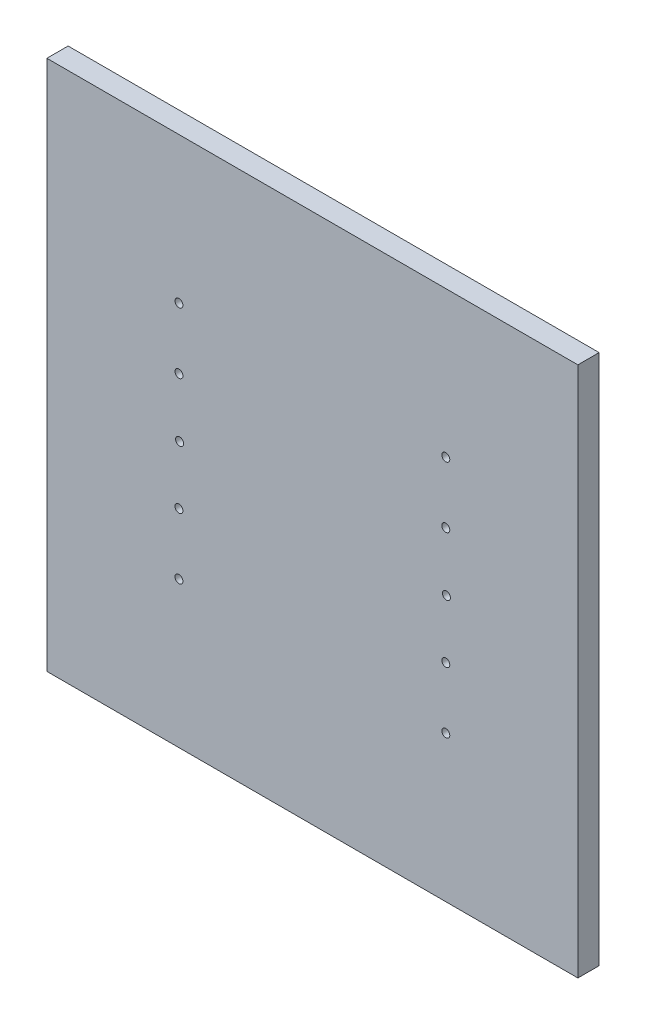
ISO-10303-21;
HEADER;
FILE_DESCRIPTION(('STEP AP214'),'2;1');
FILE_NAME('part.step','',(''),(''),'','','');
FILE_SCHEMA(('AUTOMOTIVE_DESIGN { 1 0 10303 214 1 1 1 1 }'));
ENDSEC;
DATA;
#1=APPLICATION_CONTEXT('core data for automotive mechanical design processes');
#2=APPLICATION_PROTOCOL_DEFINITION('international standard','automotive_design',2000,#1);
#3=PRODUCT_CONTEXT('',#1,'mechanical');
#4=PRODUCT('Part','Part','',(#3));
#5=PRODUCT_RELATED_PRODUCT_CATEGORY('part','',(#4));
#6=PRODUCT_DEFINITION_FORMATION('','',#4);
#7=PRODUCT_DEFINITION_CONTEXT('part definition',#1,'design');
#8=PRODUCT_DEFINITION('design','',#6,#7);
#9=PRODUCT_DEFINITION_SHAPE('','',#8);
#10=(LENGTH_UNIT() NAMED_UNIT(*) SI_UNIT(.MILLI.,.METRE.));
#11=(NAMED_UNIT(*) PLANE_ANGLE_UNIT() SI_UNIT($,.RADIAN.));
#12=(NAMED_UNIT(*) SI_UNIT($,.STERADIAN.) SOLID_ANGLE_UNIT());
#13=UNCERTAINTY_MEASURE_WITH_UNIT(LENGTH_MEASURE(1.E-05),#10,'distance_accuracy_value','');
#14=(GEOMETRIC_REPRESENTATION_CONTEXT(3) GLOBAL_UNCERTAINTY_ASSIGNED_CONTEXT((#13)) GLOBAL_UNIT_ASSIGNED_CONTEXT((#10,
#11,#12)) REPRESENTATION_CONTEXT('',''));
#15=CARTESIAN_POINT('',(0.,0.,0.));
#16=DIRECTION('',(0.,0.,1.));
#17=DIRECTION('',(1.,0.,0.));
#18=AXIS2_PLACEMENT_3D('',#15,#16,#17);
#19=CARTESIAN_POINT('',(0.,0.,8.));
#20=DIRECTION('',(1.,0.,0.));
#21=DIRECTION('',(0.,0.,-1.));
#22=AXIS2_PLACEMENT_3D('',#19,#20,#21);
#23=PLANE('',#22);
#24=DIRECTION('',(0.,-1.,0.));
#25=VECTOR('',#24,1.);
#26=CARTESIAN_POINT('',(0.,0.,0.));
#27=LINE('',#26,#25);
#28=CARTESIAN_POINT('',(0.,200.,0.));
#29=VERTEX_POINT('',#28);
#30=CARTESIAN_POINT('',(0.,0.,0.));
#31=VERTEX_POINT('',#30);
#32=EDGE_CURVE('E101',#29,#31,#27,.T.);
#33=ORIENTED_EDGE('',*,*,#32,.T.);
#34=DIRECTION('',(0.,0.,-1.));
#35=VECTOR('',#34,1.);
#36=CARTESIAN_POINT('',(0.,0.,8.));
#37=LINE('',#36,#35);
#38=CARTESIAN_POINT('',(0.,0.,8.));
#39=VERTEX_POINT('',#38);
#40=EDGE_CURVE('E11',#39,#31,#37,.T.);
#41=ORIENTED_EDGE('',*,*,#40,.F.);
#42=DIRECTION('',(0.,-1.,0.));
#43=VECTOR('',#42,1.);
#44=CARTESIAN_POINT('',(0.,0.,8.));
#45=LINE('',#44,#43);
#46=CARTESIAN_POINT('',(0.,200.,8.));
#47=VERTEX_POINT('',#46);
#48=EDGE_CURVE('E88',#47,#39,#45,.T.);
#49=ORIENTED_EDGE('',*,*,#48,.F.);
#50=DIRECTION('',(0.,0.,-1.));
#51=VECTOR('',#50,1.);
#52=CARTESIAN_POINT('',(0.,200.,8.));
#53=LINE('',#52,#51);
#54=EDGE_CURVE('E97',#47,#29,#53,.T.);
#55=ORIENTED_EDGE('',*,*,#54,.T.);
#56=EDGE_LOOP('',(#33,#41,#49,#55));
#57=FACE_BOUND('',#56,.T.);
#58=ADVANCED_FACE('F35',(#57),#23,.F.);
#59=CARTESIAN_POINT('',(0.,0.,8.));
#60=DIRECTION('',(0.,1.,0.));
#61=DIRECTION('',(0.,0.,1.));
#62=AXIS2_PLACEMENT_3D('',#59,#60,#61);
#63=PLANE('',#62);
#64=DIRECTION('',(1.,0.,0.));
#65=VECTOR('',#64,1.);
#66=CARTESIAN_POINT('',(0.,0.,0.));
#67=LINE('',#66,#65);
#68=CARTESIAN_POINT('',(200.,0.,0.));
#69=VERTEX_POINT('',#68);
#70=EDGE_CURVE('E92',#31,#69,#67,.T.);
#71=ORIENTED_EDGE('',*,*,#70,.T.);
#72=DIRECTION('',(0.,0.,-1.));
#73=VECTOR('',#72,1.);
#74=CARTESIAN_POINT('',(200.,0.,8.));
#75=LINE('',#74,#73);
#76=CARTESIAN_POINT('',(200.,0.,8.));
#77=VERTEX_POINT('',#76);
#78=EDGE_CURVE('E44',#77,#69,#75,.T.);
#79=ORIENTED_EDGE('',*,*,#78,.F.);
#80=DIRECTION('',(1.,0.,0.));
#81=VECTOR('',#80,1.);
#82=CARTESIAN_POINT('',(0.,0.,8.));
#83=LINE('',#82,#81);
#84=EDGE_CURVE('E83',#39,#77,#83,.T.);
#85=ORIENTED_EDGE('',*,*,#84,.F.);
#86=ORIENTED_EDGE('',*,*,#40,.T.);
#87=EDGE_LOOP('',(#71,#79,#85,#86));
#88=FACE_BOUND('',#87,.T.);
#89=ADVANCED_FACE('F91',(#88),#63,.F.);
#90=CARTESIAN_POINT('',(200.,0.,8.));
#91=DIRECTION('',(-1.,0.,0.));
#92=DIRECTION('',(0.,0.,1.));
#93=AXIS2_PLACEMENT_3D('',#90,#91,#92);
#94=PLANE('',#93);
#95=DIRECTION('',(0.,1.,0.));
#96=VECTOR('',#95,1.);
#97=CARTESIAN_POINT('',(200.,0.,0.));
#98=LINE('',#97,#96);
#99=CARTESIAN_POINT('',(200.,200.,0.));
#100=VERTEX_POINT('',#99);
#101=EDGE_CURVE('E70',#69,#100,#98,.T.);
#102=ORIENTED_EDGE('',*,*,#101,.T.);
#103=DIRECTION('',(0.,0.,-1.));
#104=VECTOR('',#103,1.);
#105=CARTESIAN_POINT('',(200.,200.,8.));
#106=LINE('',#105,#104);
#107=CARTESIAN_POINT('',(200.,200.,8.));
#108=VERTEX_POINT('',#107);
#109=EDGE_CURVE('E93',#108,#100,#106,.T.);
#110=ORIENTED_EDGE('',*,*,#109,.F.);
#111=DIRECTION('',(0.,1.,0.));
#112=VECTOR('',#111,1.);
#113=CARTESIAN_POINT('',(200.,0.,8.));
#114=LINE('',#113,#112);
#115=EDGE_CURVE('E86',#77,#108,#114,.T.);
#116=ORIENTED_EDGE('',*,*,#115,.F.);
#117=ORIENTED_EDGE('',*,*,#78,.T.);
#118=EDGE_LOOP('',(#102,#110,#116,#117));
#119=FACE_BOUND('',#118,.T.);
#120=ADVANCED_FACE('F95',(#119),#94,.F.);
#121=CARTESIAN_POINT('',(0.,200.,8.));
#122=DIRECTION('',(0.,-1.,0.));
#123=DIRECTION('',(0.,0.,-1.));
#124=AXIS2_PLACEMENT_3D('',#121,#122,#123);
#125=PLANE('',#124);
#126=DIRECTION('',(-1.,0.,0.));
#127=VECTOR('',#126,1.);
#128=CARTESIAN_POINT('',(0.,200.,0.));
#129=LINE('',#128,#127);
#130=EDGE_CURVE('E76',#100,#29,#129,.T.);
#131=ORIENTED_EDGE('',*,*,#130,.T.);
#132=ORIENTED_EDGE('',*,*,#54,.F.);
#133=DIRECTION('',(-1.,0.,0.));
#134=VECTOR('',#133,1.);
#135=CARTESIAN_POINT('',(0.,200.,8.));
#136=LINE('',#135,#134);
#137=EDGE_CURVE('E53',#108,#47,#136,.T.);
#138=ORIENTED_EDGE('',*,*,#137,.F.);
#139=ORIENTED_EDGE('',*,*,#109,.T.);
#140=EDGE_LOOP('',(#131,#132,#138,#139));
#141=FACE_BOUND('',#140,.T.);
#142=ADVANCED_FACE('F205',(#141),#125,.F.);
#143=CARTESIAN_POINT('',(0.,0.,8.));
#144=DIRECTION('',(0.,0.,-1.));
#145=DIRECTION('',(-1.,0.,0.));
#146=AXIS2_PLACEMENT_3D('',#143,#144,#145);
#147=PLANE('',#146);
#148=CARTESIAN_POINT('',(150.5,100.,8.));
#149=DIRECTION('',(0.,0.,-1.));
#150=DIRECTION('',(-1.,0.,0.));
#151=AXIS2_PLACEMENT_3D('',#148,#149,#150);
#152=CIRCLE('',#151,1.5);
#153=CARTESIAN_POINT('',(149.,100.,8.));
#154=VERTEX_POINT('',#153);
#155=EDGE_CURVE('E38',#154,#154,#152,.T.);
#156=ORIENTED_EDGE('',*,*,#155,.T.);
#157=EDGE_LOOP('',(#156));
#158=FACE_BOUND('',#157,.T.);
#159=CARTESIAN_POINT('',(150.25,145.,8.));
#160=DIRECTION('',(0.,0.,-1.));
#161=DIRECTION('',(-1.,0.,0.));
#162=AXIS2_PLACEMENT_3D('',#159,#160,#161);
#163=CIRCLE('',#162,1.5);
#164=CARTESIAN_POINT('',(148.75,145.,8.));
#165=VERTEX_POINT('',#164);
#166=EDGE_CURVE('E554',#165,#165,#163,.T.);
#167=ORIENTED_EDGE('',*,*,#166,.T.);
#168=EDGE_LOOP('',(#167));
#169=FACE_BOUND('',#168,.T.);
#170=CARTESIAN_POINT('',(150.25,121.99689141647,8.));
#171=DIRECTION('',(0.,0.,-1.));
#172=DIRECTION('',(-1.,0.,0.));
#173=AXIS2_PLACEMENT_3D('',#170,#171,#172);
#174=CIRCLE('',#173,1.5);
#175=CARTESIAN_POINT('',(148.75,121.99689141647,8.));
#176=VERTEX_POINT('',#175);
#177=EDGE_CURVE('E566',#176,#176,#174,.T.);
#178=ORIENTED_EDGE('',*,*,#177,.T.);
#179=EDGE_LOOP('',(#178));
#180=FACE_BOUND('',#179,.T.);
#181=CARTESIAN_POINT('',(150.25,78.0125142132843,8.));
#182=DIRECTION('',(0.,0.,-1.));
#183=DIRECTION('',(-1.,0.,0.));
#184=AXIS2_PLACEMENT_3D('',#181,#182,#183);
#185=CIRCLE('',#184,1.5);
#186=CARTESIAN_POINT('',(148.75,78.0125142132843,8.));
#187=VERTEX_POINT('',#186);
#188=EDGE_CURVE('E578',#187,#187,#185,.T.);
#189=ORIENTED_EDGE('',*,*,#188,.T.);
#190=EDGE_LOOP('',(#189));
#191=FACE_BOUND('',#190,.T.);
#192=CARTESIAN_POINT('',(150.25,55.0095344714492,8.));
#193=DIRECTION('',(0.,0.,-1.));
#194=DIRECTION('',(-1.,0.,0.));
#195=AXIS2_PLACEMENT_3D('',#192,#193,#194);
#196=CIRCLE('',#195,1.5);
#197=CARTESIAN_POINT('',(148.75,55.0095344714492,8.));
#198=VERTEX_POINT('',#197);
#199=EDGE_CURVE('E119',#198,#198,#196,.T.);
#200=ORIENTED_EDGE('',*,*,#199,.T.);
#201=EDGE_LOOP('',(#200));
#202=FACE_BOUND('',#201,.T.);
#203=CARTESIAN_POINT('',(50.,100.,8.));
#204=DIRECTION('',(0.,0.,-1.));
#205=DIRECTION('',(-1.,0.,0.));
#206=AXIS2_PLACEMENT_3D('',#203,#204,#205);
#207=CIRCLE('',#206,1.5);
#208=CARTESIAN_POINT('',(48.5,100.,8.));
#209=VERTEX_POINT('',#208);
#210=EDGE_CURVE('E109',#209,#209,#207,.T.);
#211=ORIENTED_EDGE('',*,*,#210,.T.);
#212=EDGE_LOOP('',(#211));
#213=FACE_BOUND('',#212,.T.);
#214=CARTESIAN_POINT('',(49.75,145.,8.));
#215=DIRECTION('',(0.,0.,-1.));
#216=DIRECTION('',(-1.,0.,0.));
#217=AXIS2_PLACEMENT_3D('',#214,#215,#216);
#218=CIRCLE('',#217,1.5);
#219=CARTESIAN_POINT('',(48.25,145.,8.));
#220=VERTEX_POINT('',#219);
#221=EDGE_CURVE('E139',#220,#220,#218,.T.);
#222=ORIENTED_EDGE('',*,*,#221,.T.);
#223=EDGE_LOOP('',(#222));
#224=FACE_BOUND('',#223,.T.);
#225=CARTESIAN_POINT('',(49.75,121.99689141647,8.));
#226=DIRECTION('',(0.,0.,-1.));
#227=DIRECTION('',(-1.,0.,0.));
#228=AXIS2_PLACEMENT_3D('',#225,#226,#227);
#229=CIRCLE('',#228,1.5);
#230=CARTESIAN_POINT('',(48.25,121.99689141647,8.));
#231=VERTEX_POINT('',#230);
#232=EDGE_CURVE('E151',#231,#231,#229,.T.);
#233=ORIENTED_EDGE('',*,*,#232,.T.);
#234=EDGE_LOOP('',(#233));
#235=FACE_BOUND('',#234,.T.);
#236=CARTESIAN_POINT('',(49.75,78.0125142132843,8.));
#237=DIRECTION('',(0.,0.,-1.));
#238=DIRECTION('',(-1.,0.,0.));
#239=AXIS2_PLACEMENT_3D('',#236,#237,#238);
#240=CIRCLE('',#239,1.5);
#241=CARTESIAN_POINT('',(48.25,78.0125142132843,8.));
#242=VERTEX_POINT('',#241);
#243=EDGE_CURVE('E163',#242,#242,#240,.T.);
#244=ORIENTED_EDGE('',*,*,#243,.T.);
#245=EDGE_LOOP('',(#244));
#246=FACE_BOUND('',#245,.T.);
#247=CARTESIAN_POINT('',(49.75,55.0095344714492,8.));
#248=DIRECTION('',(0.,0.,-1.));
#249=DIRECTION('',(-1.,0.,0.));
#250=AXIS2_PLACEMENT_3D('',#247,#248,#249);
#251=CIRCLE('',#250,1.5);
#252=CARTESIAN_POINT('',(48.25,55.0095344714492,8.));
#253=VERTEX_POINT('',#252);
#254=EDGE_CURVE('E104',#253,#253,#251,.T.);
#255=ORIENTED_EDGE('',*,*,#254,.T.);
#256=EDGE_LOOP('',(#255));
#257=FACE_BOUND('',#256,.T.);
#258=ORIENTED_EDGE('',*,*,#48,.T.);
#259=ORIENTED_EDGE('',*,*,#84,.T.);
#260=ORIENTED_EDGE('',*,*,#115,.T.);
#261=ORIENTED_EDGE('',*,*,#137,.T.);
#262=EDGE_LOOP('',(#258,#259,#260,#261));
#263=FACE_BOUND('',#262,.T.);
#264=ADVANCED_FACE('F84',(#158,#169,#180,#191,#202,#213,#224,#235,#246,#257,#263),#147,.F.);
#265=CARTESIAN_POINT('',(0.,0.,0.));
#266=DIRECTION('',(0.,0.,-1.));
#267=DIRECTION('',(-1.,0.,0.));
#268=AXIS2_PLACEMENT_3D('',#265,#266,#267);
#269=PLANE('',#268);
#270=CARTESIAN_POINT('',(150.5,100.,0.));
#271=DIRECTION('',(0.,0.,-1.));
#272=DIRECTION('',(-1.,0.,0.));
#273=AXIS2_PLACEMENT_3D('',#270,#271,#272);
#274=CIRCLE('',#273,2.5);
#275=CARTESIAN_POINT('',(148.,100.,0.));
#276=VERTEX_POINT('',#275);
#277=EDGE_CURVE('E537',#276,#276,#274,.T.);
#278=ORIENTED_EDGE('',*,*,#277,.F.);
#279=EDGE_LOOP('',(#278));
#280=FACE_BOUND('',#279,.T.);
#281=CARTESIAN_POINT('',(150.25,145.,0.));
#282=DIRECTION('',(0.,0.,-1.));
#283=DIRECTION('',(-1.,0.,0.));
#284=AXIS2_PLACEMENT_3D('',#281,#282,#283);
#285=CIRCLE('',#284,2.5);
#286=CARTESIAN_POINT('',(147.75,145.,0.));
#287=VERTEX_POINT('',#286);
#288=EDGE_CURVE('E544',#287,#287,#285,.T.);
#289=ORIENTED_EDGE('',*,*,#288,.F.);
#290=EDGE_LOOP('',(#289));
#291=FACE_BOUND('',#290,.T.);
#292=CARTESIAN_POINT('',(150.25,121.99689141647,0.));
#293=DIRECTION('',(0.,0.,-1.));
#294=DIRECTION('',(-1.,0.,0.));
#295=AXIS2_PLACEMENT_3D('',#292,#293,#294);
#296=CIRCLE('',#295,2.5);
#297=CARTESIAN_POINT('',(147.75,121.99689141647,0.));
#298=VERTEX_POINT('',#297);
#299=EDGE_CURVE('E557',#298,#298,#296,.T.);
#300=ORIENTED_EDGE('',*,*,#299,.F.);
#301=EDGE_LOOP('',(#300));
#302=FACE_BOUND('',#301,.T.);
#303=CARTESIAN_POINT('',(150.25,78.0125142132843,0.));
#304=DIRECTION('',(0.,0.,-1.));
#305=DIRECTION('',(-1.,0.,0.));
#306=AXIS2_PLACEMENT_3D('',#303,#304,#305);
#307=CIRCLE('',#306,2.5);
#308=CARTESIAN_POINT('',(147.75,78.0125142132843,0.));
#309=VERTEX_POINT('',#308);
#310=EDGE_CURVE('E569',#309,#309,#307,.T.);
#311=ORIENTED_EDGE('',*,*,#310,.F.);
#312=EDGE_LOOP('',(#311));
#313=FACE_BOUND('',#312,.T.);
#314=CARTESIAN_POINT('',(150.25,55.0095344714492,0.));
#315=DIRECTION('',(0.,0.,-1.));
#316=DIRECTION('',(-1.,0.,0.));
#317=AXIS2_PLACEMENT_3D('',#314,#315,#316);
#318=CIRCLE('',#317,2.5);
#319=CARTESIAN_POINT('',(147.75,55.0095344714492,0.));
#320=VERTEX_POINT('',#319);
#321=EDGE_CURVE('E581',#320,#320,#318,.T.);
#322=ORIENTED_EDGE('',*,*,#321,.F.);
#323=EDGE_LOOP('',(#322));
#324=FACE_BOUND('',#323,.T.);
#325=CARTESIAN_POINT('',(50.,100.,0.));
#326=DIRECTION('',(0.,0.,-1.));
#327=DIRECTION('',(-1.,0.,0.));
#328=AXIS2_PLACEMENT_3D('',#325,#326,#327);
#329=CIRCLE('',#328,2.5);
#330=CARTESIAN_POINT('',(47.5,100.,0.));
#331=VERTEX_POINT('',#330);
#332=EDGE_CURVE('E111',#331,#331,#329,.T.);
#333=ORIENTED_EDGE('',*,*,#332,.F.);
#334=EDGE_LOOP('',(#333));
#335=FACE_BOUND('',#334,.T.);
#336=CARTESIAN_POINT('',(49.75,145.,0.));
#337=DIRECTION('',(0.,0.,-1.));
#338=DIRECTION('',(-1.,0.,0.));
#339=AXIS2_PLACEMENT_3D('',#336,#337,#338);
#340=CIRCLE('',#339,2.5);
#341=CARTESIAN_POINT('',(47.25,145.,0.));
#342=VERTEX_POINT('',#341);
#343=EDGE_CURVE('E129',#342,#342,#340,.T.);
#344=ORIENTED_EDGE('',*,*,#343,.F.);
#345=EDGE_LOOP('',(#344));
#346=FACE_BOUND('',#345,.T.);
#347=CARTESIAN_POINT('',(49.75,121.99689141647,0.));
#348=DIRECTION('',(0.,0.,-1.));
#349=DIRECTION('',(-1.,0.,0.));
#350=AXIS2_PLACEMENT_3D('',#347,#348,#349);
#351=CIRCLE('',#350,2.5);
#352=CARTESIAN_POINT('',(47.25,121.99689141647,0.));
#353=VERTEX_POINT('',#352);
#354=EDGE_CURVE('E142',#353,#353,#351,.T.);
#355=ORIENTED_EDGE('',*,*,#354,.F.);
#356=EDGE_LOOP('',(#355));
#357=FACE_BOUND('',#356,.T.);
#358=CARTESIAN_POINT('',(49.75,78.0125142132843,0.));
#359=DIRECTION('',(0.,0.,-1.));
#360=DIRECTION('',(-1.,0.,0.));
#361=AXIS2_PLACEMENT_3D('',#358,#359,#360);
#362=CIRCLE('',#361,2.5);
#363=CARTESIAN_POINT('',(47.25,78.0125142132843,0.));
#364=VERTEX_POINT('',#363);
#365=EDGE_CURVE('E154',#364,#364,#362,.T.);
#366=ORIENTED_EDGE('',*,*,#365,.F.);
#367=EDGE_LOOP('',(#366));
#368=FACE_BOUND('',#367,.T.);
#369=CARTESIAN_POINT('',(49.75,55.0095344714492,0.));
#370=DIRECTION('',(0.,0.,-1.));
#371=DIRECTION('',(-1.,0.,0.));
#372=AXIS2_PLACEMENT_3D('',#369,#370,#371);
#373=CIRCLE('',#372,2.5);
#374=CARTESIAN_POINT('',(47.25,55.0095344714492,0.));
#375=VERTEX_POINT('',#374);
#376=EDGE_CURVE('E166',#375,#375,#373,.T.);
#377=ORIENTED_EDGE('',*,*,#376,.F.);
#378=EDGE_LOOP('',(#377));
#379=FACE_BOUND('',#378,.T.);
#380=ORIENTED_EDGE('',*,*,#32,.F.);
#381=ORIENTED_EDGE('',*,*,#130,.F.);
#382=ORIENTED_EDGE('',*,*,#101,.F.);
#383=ORIENTED_EDGE('',*,*,#70,.F.);
#384=EDGE_LOOP('',(#380,#381,#382,#383));
#385=FACE_BOUND('',#384,.T.);
#386=ADVANCED_FACE('F183',(#280,#291,#302,#313,#324,#335,#346,#357,#368,#379,#385),#269,.T.);
#387=CARTESIAN_POINT('',(49.75,55.0095344714492,0.));
#388=DIRECTION('',(0.,0.,-1.));
#389=DIRECTION('',(-1.,0.,0.));
#390=AXIS2_PLACEMENT_3D('',#387,#388,#389);
#391=CYLINDRICAL_SURFACE('',#390,1.5);
#392=ORIENTED_EDGE('',*,*,#254,.F.);
#393=EDGE_LOOP('',(#392));
#394=FACE_BOUND('',#393,.T.);
#395=CARTESIAN_POINT('',(49.75,55.0095344714492,4.));
#396=DIRECTION('',(0.,0.,-1.));
#397=DIRECTION('',(-1.,0.,0.));
#398=AXIS2_PLACEMENT_3D('',#395,#396,#397);
#399=CIRCLE('',#398,1.5);
#400=CARTESIAN_POINT('',(48.25,55.0095344714492,4.));
#401=VERTEX_POINT('',#400);
#402=EDGE_CURVE('E172',#401,#401,#399,.T.);
#403=ORIENTED_EDGE('',*,*,#402,.T.);
#404=EDGE_LOOP('',(#403));
#405=FACE_BOUND('',#404,.T.);
#406=ADVANCED_FACE('F179',(#394,#405),#391,.F.);
#407=CARTESIAN_POINT('',(51.25,55.0095344714492,4.));
#408=DIRECTION('',(0.,0.,1.));
#409=DIRECTION('',(1.,0.,0.));
#410=AXIS2_PLACEMENT_3D('',#407,#408,#409);
#411=PLANE('',#410);
#412=ORIENTED_EDGE('',*,*,#402,.F.);
#413=EDGE_LOOP('',(#412));
#414=FACE_BOUND('',#413,.T.);
#415=CARTESIAN_POINT('',(49.75,55.0095344714492,4.));
#416=DIRECTION('',(0.,0.,-1.));
#417=DIRECTION('',(-1.,0.,0.));
#418=AXIS2_PLACEMENT_3D('',#415,#416,#417);
#419=CIRCLE('',#418,2.5);
#420=CARTESIAN_POINT('',(47.25,55.0095344714492,4.));
#421=VERTEX_POINT('',#420);
#422=EDGE_CURVE('E169',#421,#421,#419,.T.);
#423=ORIENTED_EDGE('',*,*,#422,.T.);
#424=EDGE_LOOP('',(#423));
#425=FACE_BOUND('',#424,.T.);
#426=ADVANCED_FACE('F182',(#414,#425),#411,.F.);
#427=CARTESIAN_POINT('',(49.75,55.0095344714492,0.));
#428=DIRECTION('',(0.,0.,-1.));
#429=DIRECTION('',(-1.,0.,0.));
#430=AXIS2_PLACEMENT_3D('',#427,#428,#429);
#431=CYLINDRICAL_SURFACE('',#430,2.5);
#432=ORIENTED_EDGE('',*,*,#422,.F.);
#433=EDGE_LOOP('',(#432));
#434=FACE_BOUND('',#433,.T.);
#435=ORIENTED_EDGE('',*,*,#376,.T.);
#436=EDGE_LOOP('',(#435));
#437=FACE_BOUND('',#436,.T.);
#438=ADVANCED_FACE('F189',(#434,#437),#431,.F.);
#439=CARTESIAN_POINT('',(49.75,78.0125142132843,0.));
#440=DIRECTION('',(0.,0.,-1.));
#441=DIRECTION('',(-1.,0.,0.));
#442=AXIS2_PLACEMENT_3D('',#439,#440,#441);
#443=CYLINDRICAL_SURFACE('',#442,1.5);
#444=ORIENTED_EDGE('',*,*,#243,.F.);
#445=EDGE_LOOP('',(#444));
#446=FACE_BOUND('',#445,.T.);
#447=CARTESIAN_POINT('',(49.75,78.0125142132843,4.));
#448=DIRECTION('',(0.,0.,-1.));
#449=DIRECTION('',(-1.,0.,0.));
#450=AXIS2_PLACEMENT_3D('',#447,#448,#449);
#451=CIRCLE('',#450,1.5);
#452=CARTESIAN_POINT('',(48.25,78.0125142132843,4.));
#453=VERTEX_POINT('',#452);
#454=EDGE_CURVE('E160',#453,#453,#451,.T.);
#455=ORIENTED_EDGE('',*,*,#454,.T.);
#456=EDGE_LOOP('',(#455));
#457=FACE_BOUND('',#456,.T.);
#458=ADVANCED_FACE('F195',(#446,#457),#443,.F.);
#459=CARTESIAN_POINT('',(51.25,78.0125142132843,4.));
#460=DIRECTION('',(0.,0.,1.));
#461=DIRECTION('',(1.,0.,0.));
#462=AXIS2_PLACEMENT_3D('',#459,#460,#461);
#463=PLANE('',#462);
#464=ORIENTED_EDGE('',*,*,#454,.F.);
#465=EDGE_LOOP('',(#464));
#466=FACE_BOUND('',#465,.T.);
#467=CARTESIAN_POINT('',(49.75,78.0125142132843,4.));
#468=DIRECTION('',(0.,0.,-1.));
#469=DIRECTION('',(-1.,0.,0.));
#470=AXIS2_PLACEMENT_3D('',#467,#468,#469);
#471=CIRCLE('',#470,2.5);
#472=CARTESIAN_POINT('',(47.25,78.0125142132843,4.));
#473=VERTEX_POINT('',#472);
#474=EDGE_CURVE('E157',#473,#473,#471,.T.);
#475=ORIENTED_EDGE('',*,*,#474,.T.);
#476=EDGE_LOOP('',(#475));
#477=FACE_BOUND('',#476,.T.);
#478=ADVANCED_FACE('F258',(#466,#477),#463,.F.);
#479=CARTESIAN_POINT('',(49.75,78.0125142132843,0.));
#480=DIRECTION('',(0.,0.,-1.));
#481=DIRECTION('',(-1.,0.,0.));
#482=AXIS2_PLACEMENT_3D('',#479,#480,#481);
#483=CYLINDRICAL_SURFACE('',#482,2.5);
#484=ORIENTED_EDGE('',*,*,#474,.F.);
#485=EDGE_LOOP('',(#484));
#486=FACE_BOUND('',#485,.T.);
#487=ORIENTED_EDGE('',*,*,#365,.T.);
#488=EDGE_LOOP('',(#487));
#489=FACE_BOUND('',#488,.T.);
#490=ADVANCED_FACE('F268',(#486,#489),#483,.F.);
#491=CARTESIAN_POINT('',(49.75,121.99689141647,0.));
#492=DIRECTION('',(0.,0.,-1.));
#493=DIRECTION('',(-1.,0.,0.));
#494=AXIS2_PLACEMENT_3D('',#491,#492,#493);
#495=CYLINDRICAL_SURFACE('',#494,1.5);
#496=ORIENTED_EDGE('',*,*,#232,.F.);
#497=EDGE_LOOP('',(#496));
#498=FACE_BOUND('',#497,.T.);
#499=CARTESIAN_POINT('',(49.75,121.99689141647,4.));
#500=DIRECTION('',(0.,0.,-1.));
#501=DIRECTION('',(-1.,0.,0.));
#502=AXIS2_PLACEMENT_3D('',#499,#500,#501);
#503=CIRCLE('',#502,1.5);
#504=CARTESIAN_POINT('',(48.25,121.99689141647,4.));
#505=VERTEX_POINT('',#504);
#506=EDGE_CURVE('E148',#505,#505,#503,.T.);
#507=ORIENTED_EDGE('',*,*,#506,.T.);
#508=EDGE_LOOP('',(#507));
#509=FACE_BOUND('',#508,.T.);
#510=ADVANCED_FACE('F278',(#498,#509),#495,.F.);
#511=CARTESIAN_POINT('',(51.25,121.99689141647,4.));
#512=DIRECTION('',(0.,0.,1.));
#513=DIRECTION('',(1.,0.,0.));
#514=AXIS2_PLACEMENT_3D('',#511,#512,#513);
#515=PLANE('',#514);
#516=ORIENTED_EDGE('',*,*,#506,.F.);
#517=EDGE_LOOP('',(#516));
#518=FACE_BOUND('',#517,.T.);
#519=CARTESIAN_POINT('',(49.75,121.99689141647,4.));
#520=DIRECTION('',(0.,0.,-1.));
#521=DIRECTION('',(-1.,0.,0.));
#522=AXIS2_PLACEMENT_3D('',#519,#520,#521);
#523=CIRCLE('',#522,2.5);
#524=CARTESIAN_POINT('',(47.25,121.99689141647,4.));
#525=VERTEX_POINT('',#524);
#526=EDGE_CURVE('E145',#525,#525,#523,.T.);
#527=ORIENTED_EDGE('',*,*,#526,.T.);
#528=EDGE_LOOP('',(#527));
#529=FACE_BOUND('',#528,.T.);
#530=ADVANCED_FACE('F288',(#518,#529),#515,.F.);
#531=CARTESIAN_POINT('',(49.75,121.99689141647,0.));
#532=DIRECTION('',(0.,0.,-1.));
#533=DIRECTION('',(-1.,0.,0.));
#534=AXIS2_PLACEMENT_3D('',#531,#532,#533);
#535=CYLINDRICAL_SURFACE('',#534,2.5);
#536=ORIENTED_EDGE('',*,*,#526,.F.);
#537=EDGE_LOOP('',(#536));
#538=FACE_BOUND('',#537,.T.);
#539=ORIENTED_EDGE('',*,*,#354,.T.);
#540=EDGE_LOOP('',(#539));
#541=FACE_BOUND('',#540,.T.);
#542=ADVANCED_FACE('F298',(#538,#541),#535,.F.);
#543=CARTESIAN_POINT('',(49.75,145.,0.));
#544=DIRECTION('',(0.,0.,-1.));
#545=DIRECTION('',(-1.,0.,0.));
#546=AXIS2_PLACEMENT_3D('',#543,#544,#545);
#547=CYLINDRICAL_SURFACE('',#546,1.5);
#548=ORIENTED_EDGE('',*,*,#221,.F.);
#549=EDGE_LOOP('',(#548));
#550=FACE_BOUND('',#549,.T.);
#551=CARTESIAN_POINT('',(49.75,145.,4.));
#552=DIRECTION('',(0.,0.,-1.));
#553=DIRECTION('',(-1.,0.,0.));
#554=AXIS2_PLACEMENT_3D('',#551,#552,#553);
#555=CIRCLE('',#554,1.5);
#556=CARTESIAN_POINT('',(48.25,145.,4.));
#557=VERTEX_POINT('',#556);
#558=EDGE_CURVE('E136',#557,#557,#555,.T.);
#559=ORIENTED_EDGE('',*,*,#558,.T.);
#560=EDGE_LOOP('',(#559));
#561=FACE_BOUND('',#560,.T.);
#562=ADVANCED_FACE('F308',(#550,#561),#547,.F.);
#563=CARTESIAN_POINT('',(51.25,145.,4.));
#564=DIRECTION('',(0.,0.,1.));
#565=DIRECTION('',(1.,0.,0.));
#566=AXIS2_PLACEMENT_3D('',#563,#564,#565);
#567=PLANE('',#566);
#568=ORIENTED_EDGE('',*,*,#558,.F.);
#569=EDGE_LOOP('',(#568));
#570=FACE_BOUND('',#569,.T.);
#571=CARTESIAN_POINT('',(49.75,145.,4.));
#572=DIRECTION('',(0.,0.,-1.));
#573=DIRECTION('',(-1.,0.,0.));
#574=AXIS2_PLACEMENT_3D('',#571,#572,#573);
#575=CIRCLE('',#574,2.5);
#576=CARTESIAN_POINT('',(47.25,145.,4.));
#577=VERTEX_POINT('',#576);
#578=EDGE_CURVE('E133',#577,#577,#575,.T.);
#579=ORIENTED_EDGE('',*,*,#578,.T.);
#580=EDGE_LOOP('',(#579));
#581=FACE_BOUND('',#580,.T.);
#582=ADVANCED_FACE('F318',(#570,#581),#567,.F.);
#583=CARTESIAN_POINT('',(49.75,145.,0.));
#584=DIRECTION('',(0.,0.,-1.));
#585=DIRECTION('',(-1.,0.,0.));
#586=AXIS2_PLACEMENT_3D('',#583,#584,#585);
#587=CYLINDRICAL_SURFACE('',#586,2.5);
#588=ORIENTED_EDGE('',*,*,#578,.F.);
#589=EDGE_LOOP('',(#588));
#590=FACE_BOUND('',#589,.T.);
#591=ORIENTED_EDGE('',*,*,#343,.T.);
#592=EDGE_LOOP('',(#591));
#593=FACE_BOUND('',#592,.T.);
#594=ADVANCED_FACE('F328',(#590,#593),#587,.F.);
#595=CARTESIAN_POINT('',(50.,100.,4.));
#596=DIRECTION('',(0.,0.,-1.));
#597=DIRECTION('',(-1.,0.,0.));
#598=AXIS2_PLACEMENT_3D('',#595,#596,#597);
#599=CYLINDRICAL_SURFACE('',#598,2.5);
#600=CARTESIAN_POINT('',(50.,100.,4.));
#601=DIRECTION('',(0.,0.,-1.));
#602=DIRECTION('',(-1.,0.,0.));
#603=AXIS2_PLACEMENT_3D('',#600,#601,#602);
#604=CIRCLE('',#603,2.5);
#605=CARTESIAN_POINT('',(47.5,100.,4.));
#606=VERTEX_POINT('',#605);
#607=EDGE_CURVE('E116',#606,#606,#604,.T.);
#608=ORIENTED_EDGE('',*,*,#607,.F.);
#609=EDGE_LOOP('',(#608));
#610=FACE_BOUND('',#609,.T.);
#611=ORIENTED_EDGE('',*,*,#332,.T.);
#612=EDGE_LOOP('',(#611));
#613=FACE_BOUND('',#612,.T.);
#614=ADVANCED_FACE('F338',(#610,#613),#599,.F.);
#615=CARTESIAN_POINT('',(50.,100.,4.));
#616=DIRECTION('',(0.,0.,-1.));
#617=DIRECTION('',(-1.,0.,0.));
#618=AXIS2_PLACEMENT_3D('',#615,#616,#617);
#619=PLANE('',#618);
#620=CARTESIAN_POINT('',(50.,100.,4.));
#621=DIRECTION('',(0.,0.,-1.));
#622=DIRECTION('',(-1.,0.,0.));
#623=AXIS2_PLACEMENT_3D('',#620,#621,#622);
#624=CIRCLE('',#623,1.5);
#625=CARTESIAN_POINT('',(48.5,100.,4.));
#626=VERTEX_POINT('',#625);
#627=EDGE_CURVE('E112',#626,#626,#624,.T.);
#628=ORIENTED_EDGE('',*,*,#627,.F.);
#629=EDGE_LOOP('',(#628));
#630=FACE_BOUND('',#629,.T.);
#631=ORIENTED_EDGE('',*,*,#607,.T.);
#632=EDGE_LOOP('',(#631));
#633=FACE_BOUND('',#632,.T.);
#634=ADVANCED_FACE('F348',(#630,#633),#619,.T.);
#635=CARTESIAN_POINT('',(50.,100.,14.));
#636=DIRECTION('',(0.,0.,-1.));
#637=DIRECTION('',(-1.,0.,0.));
#638=AXIS2_PLACEMENT_3D('',#635,#636,#637);
#639=CYLINDRICAL_SURFACE('',#638,1.5);
#640=ORIENTED_EDGE('',*,*,#627,.T.);
#641=EDGE_LOOP('',(#640));
#642=FACE_BOUND('',#641,.T.);
#643=ORIENTED_EDGE('',*,*,#210,.F.);
#644=EDGE_LOOP('',(#643));
#645=FACE_BOUND('',#644,.T.);
#646=ADVANCED_FACE('F358',(#642,#645),#639,.F.);
#647=CARTESIAN_POINT('',(150.25,55.0095344714492,0.));
#648=DIRECTION('',(0.,0.,-1.));
#649=DIRECTION('',(-1.,0.,0.));
#650=AXIS2_PLACEMENT_3D('',#647,#648,#649);
#651=CYLINDRICAL_SURFACE('',#650,1.5);
#652=ORIENTED_EDGE('',*,*,#199,.F.);
#653=EDGE_LOOP('',(#652));
#654=FACE_BOUND('',#653,.T.);
#655=CARTESIAN_POINT('',(150.25,55.0095344714492,4.));
#656=DIRECTION('',(0.,0.,-1.));
#657=DIRECTION('',(-1.,0.,0.));
#658=AXIS2_PLACEMENT_3D('',#655,#656,#657);
#659=CIRCLE('',#658,1.5);
#660=CARTESIAN_POINT('',(148.75,55.0095344714492,4.));
#661=VERTEX_POINT('',#660);
#662=EDGE_CURVE('E124',#661,#661,#659,.T.);
#663=ORIENTED_EDGE('',*,*,#662,.T.);
#664=EDGE_LOOP('',(#663));
#665=FACE_BOUND('',#664,.T.);
#666=ADVANCED_FACE('F368',(#654,#665),#651,.F.);
#667=CARTESIAN_POINT('',(151.75,55.0095344714492,4.));
#668=DIRECTION('',(0.,0.,1.));
#669=DIRECTION('',(1.,0.,0.));
#670=AXIS2_PLACEMENT_3D('',#667,#668,#669);
#671=PLANE('',#670);
#672=ORIENTED_EDGE('',*,*,#662,.F.);
#673=EDGE_LOOP('',(#672));
#674=FACE_BOUND('',#673,.T.);
#675=CARTESIAN_POINT('',(150.25,55.0095344714492,4.));
#676=DIRECTION('',(0.,0.,-1.));
#677=DIRECTION('',(-1.,0.,0.));
#678=AXIS2_PLACEMENT_3D('',#675,#676,#677);
#679=CIRCLE('',#678,2.5);
#680=CARTESIAN_POINT('',(147.75,55.0095344714492,4.));
#681=VERTEX_POINT('',#680);
#682=EDGE_CURVE('E584',#681,#681,#679,.T.);
#683=ORIENTED_EDGE('',*,*,#682,.T.);
#684=EDGE_LOOP('',(#683));
#685=FACE_BOUND('',#684,.T.);
#686=ADVANCED_FACE('F387',(#674,#685),#671,.F.);
#687=CARTESIAN_POINT('',(150.25,55.0095344714492,0.));
#688=DIRECTION('',(0.,0.,-1.));
#689=DIRECTION('',(-1.,0.,0.));
#690=AXIS2_PLACEMENT_3D('',#687,#688,#689);
#691=CYLINDRICAL_SURFACE('',#690,2.5);
#692=ORIENTED_EDGE('',*,*,#682,.F.);
#693=EDGE_LOOP('',(#692));
#694=FACE_BOUND('',#693,.T.);
#695=ORIENTED_EDGE('',*,*,#321,.T.);
#696=EDGE_LOOP('',(#695));
#697=FACE_BOUND('',#696,.T.);
#698=ADVANCED_FACE('F397',(#694,#697),#691,.F.);
#699=CARTESIAN_POINT('',(150.25,78.0125142132843,0.));
#700=DIRECTION('',(0.,0.,-1.));
#701=DIRECTION('',(-1.,0.,0.));
#702=AXIS2_PLACEMENT_3D('',#699,#700,#701);
#703=CYLINDRICAL_SURFACE('',#702,1.5);
#704=ORIENTED_EDGE('',*,*,#188,.F.);
#705=EDGE_LOOP('',(#704));
#706=FACE_BOUND('',#705,.T.);
#707=CARTESIAN_POINT('',(150.25,78.0125142132843,4.));
#708=DIRECTION('',(0.,0.,-1.));
#709=DIRECTION('',(-1.,0.,0.));
#710=AXIS2_PLACEMENT_3D('',#707,#708,#709);
#711=CIRCLE('',#710,1.5);
#712=CARTESIAN_POINT('',(148.75,78.0125142132843,4.));
#713=VERTEX_POINT('',#712);
#714=EDGE_CURVE('E575',#713,#713,#711,.T.);
#715=ORIENTED_EDGE('',*,*,#714,.T.);
#716=EDGE_LOOP('',(#715));
#717=FACE_BOUND('',#716,.T.);
#718=ADVANCED_FACE('F407',(#706,#717),#703,.F.);
#719=CARTESIAN_POINT('',(151.75,78.0125142132843,4.));
#720=DIRECTION('',(0.,0.,1.));
#721=DIRECTION('',(1.,0.,0.));
#722=AXIS2_PLACEMENT_3D('',#719,#720,#721);
#723=PLANE('',#722);
#724=ORIENTED_EDGE('',*,*,#714,.F.);
#725=EDGE_LOOP('',(#724));
#726=FACE_BOUND('',#725,.T.);
#727=CARTESIAN_POINT('',(150.25,78.0125142132843,4.));
#728=DIRECTION('',(0.,0.,-1.));
#729=DIRECTION('',(-1.,0.,0.));
#730=AXIS2_PLACEMENT_3D('',#727,#728,#729);
#731=CIRCLE('',#730,2.5);
#732=CARTESIAN_POINT('',(147.75,78.0125142132843,4.));
#733=VERTEX_POINT('',#732);
#734=EDGE_CURVE('E572',#733,#733,#731,.T.);
#735=ORIENTED_EDGE('',*,*,#734,.T.);
#736=EDGE_LOOP('',(#735));
#737=FACE_BOUND('',#736,.T.);
#738=ADVANCED_FACE('F417',(#726,#737),#723,.F.);
#739=CARTESIAN_POINT('',(150.25,78.0125142132843,0.));
#740=DIRECTION('',(0.,0.,-1.));
#741=DIRECTION('',(-1.,0.,0.));
#742=AXIS2_PLACEMENT_3D('',#739,#740,#741);
#743=CYLINDRICAL_SURFACE('',#742,2.5);
#744=ORIENTED_EDGE('',*,*,#734,.F.);
#745=EDGE_LOOP('',(#744));
#746=FACE_BOUND('',#745,.T.);
#747=ORIENTED_EDGE('',*,*,#310,.T.);
#748=EDGE_LOOP('',(#747));
#749=FACE_BOUND('',#748,.T.);
#750=ADVANCED_FACE('F427',(#746,#749),#743,.F.);
#751=CARTESIAN_POINT('',(150.25,121.99689141647,0.));
#752=DIRECTION('',(0.,0.,-1.));
#753=DIRECTION('',(-1.,0.,0.));
#754=AXIS2_PLACEMENT_3D('',#751,#752,#753);
#755=CYLINDRICAL_SURFACE('',#754,1.5);
#756=ORIENTED_EDGE('',*,*,#177,.F.);
#757=EDGE_LOOP('',(#756));
#758=FACE_BOUND('',#757,.T.);
#759=CARTESIAN_POINT('',(150.25,121.99689141647,4.));
#760=DIRECTION('',(0.,0.,-1.));
#761=DIRECTION('',(-1.,0.,0.));
#762=AXIS2_PLACEMENT_3D('',#759,#760,#761);
#763=CIRCLE('',#762,1.5);
#764=CARTESIAN_POINT('',(148.75,121.99689141647,4.));
#765=VERTEX_POINT('',#764);
#766=EDGE_CURVE('E563',#765,#765,#763,.T.);
#767=ORIENTED_EDGE('',*,*,#766,.T.);
#768=EDGE_LOOP('',(#767));
#769=FACE_BOUND('',#768,.T.);
#770=ADVANCED_FACE('F437',(#758,#769),#755,.F.);
#771=CARTESIAN_POINT('',(151.75,121.99689141647,4.));
#772=DIRECTION('',(0.,0.,1.));
#773=DIRECTION('',(1.,0.,0.));
#774=AXIS2_PLACEMENT_3D('',#771,#772,#773);
#775=PLANE('',#774);
#776=ORIENTED_EDGE('',*,*,#766,.F.);
#777=EDGE_LOOP('',(#776));
#778=FACE_BOUND('',#777,.T.);
#779=CARTESIAN_POINT('',(150.25,121.99689141647,4.));
#780=DIRECTION('',(0.,0.,-1.));
#781=DIRECTION('',(-1.,0.,0.));
#782=AXIS2_PLACEMENT_3D('',#779,#780,#781);
#783=CIRCLE('',#782,2.5);
#784=CARTESIAN_POINT('',(147.75,121.99689141647,4.));
#785=VERTEX_POINT('',#784);
#786=EDGE_CURVE('E560',#785,#785,#783,.T.);
#787=ORIENTED_EDGE('',*,*,#786,.T.);
#788=EDGE_LOOP('',(#787));
#789=FACE_BOUND('',#788,.T.);
#790=ADVANCED_FACE('F447',(#778,#789),#775,.F.);
#791=CARTESIAN_POINT('',(150.25,121.99689141647,0.));
#792=DIRECTION('',(0.,0.,-1.));
#793=DIRECTION('',(-1.,0.,0.));
#794=AXIS2_PLACEMENT_3D('',#791,#792,#793);
#795=CYLINDRICAL_SURFACE('',#794,2.5);
#796=ORIENTED_EDGE('',*,*,#786,.F.);
#797=EDGE_LOOP('',(#796));
#798=FACE_BOUND('',#797,.T.);
#799=ORIENTED_EDGE('',*,*,#299,.T.);
#800=EDGE_LOOP('',(#799));
#801=FACE_BOUND('',#800,.T.);
#802=ADVANCED_FACE('F457',(#798,#801),#795,.F.);
#803=CARTESIAN_POINT('',(150.25,145.,0.));
#804=DIRECTION('',(0.,0.,-1.));
#805=DIRECTION('',(-1.,0.,0.));
#806=AXIS2_PLACEMENT_3D('',#803,#804,#805);
#807=CYLINDRICAL_SURFACE('',#806,1.5);
#808=ORIENTED_EDGE('',*,*,#166,.F.);
#809=EDGE_LOOP('',(#808));
#810=FACE_BOUND('',#809,.T.);
#811=CARTESIAN_POINT('',(150.25,145.,4.));
#812=DIRECTION('',(0.,0.,-1.));
#813=DIRECTION('',(-1.,0.,0.));
#814=AXIS2_PLACEMENT_3D('',#811,#812,#813);
#815=CIRCLE('',#814,1.5);
#816=CARTESIAN_POINT('',(148.75,145.,4.));
#817=VERTEX_POINT('',#816);
#818=EDGE_CURVE('E551',#817,#817,#815,.T.);
#819=ORIENTED_EDGE('',*,*,#818,.T.);
#820=EDGE_LOOP('',(#819));
#821=FACE_BOUND('',#820,.T.);
#822=ADVANCED_FACE('F467',(#810,#821),#807,.F.);
#823=CARTESIAN_POINT('',(151.75,145.,4.));
#824=DIRECTION('',(0.,0.,1.));
#825=DIRECTION('',(1.,0.,0.));
#826=AXIS2_PLACEMENT_3D('',#823,#824,#825);
#827=PLANE('',#826);
#828=ORIENTED_EDGE('',*,*,#818,.F.);
#829=EDGE_LOOP('',(#828));
#830=FACE_BOUND('',#829,.T.);
#831=CARTESIAN_POINT('',(150.25,145.,4.));
#832=DIRECTION('',(0.,0.,-1.));
#833=DIRECTION('',(-1.,0.,0.));
#834=AXIS2_PLACEMENT_3D('',#831,#832,#833);
#835=CIRCLE('',#834,2.5);
#836=CARTESIAN_POINT('',(147.75,145.,4.));
#837=VERTEX_POINT('',#836);
#838=EDGE_CURVE('E548',#837,#837,#835,.T.);
#839=ORIENTED_EDGE('',*,*,#838,.T.);
#840=EDGE_LOOP('',(#839));
#841=FACE_BOUND('',#840,.T.);
#842=ADVANCED_FACE('F477',(#830,#841),#827,.F.);
#843=CARTESIAN_POINT('',(150.25,145.,0.));
#844=DIRECTION('',(0.,0.,-1.));
#845=DIRECTION('',(-1.,0.,0.));
#846=AXIS2_PLACEMENT_3D('',#843,#844,#845);
#847=CYLINDRICAL_SURFACE('',#846,2.5);
#848=ORIENTED_EDGE('',*,*,#838,.F.);
#849=EDGE_LOOP('',(#848));
#850=FACE_BOUND('',#849,.T.);
#851=ORIENTED_EDGE('',*,*,#288,.T.);
#852=EDGE_LOOP('',(#851));
#853=FACE_BOUND('',#852,.T.);
#854=ADVANCED_FACE('F487',(#850,#853),#847,.F.);
#855=CARTESIAN_POINT('',(150.5,100.,4.));
#856=DIRECTION('',(0.,0.,-1.));
#857=DIRECTION('',(-1.,0.,0.));
#858=AXIS2_PLACEMENT_3D('',#855,#856,#857);
#859=CYLINDRICAL_SURFACE('',#858,2.5);
#860=CARTESIAN_POINT('',(150.5,100.,4.));
#861=DIRECTION('',(0.,0.,-1.));
#862=DIRECTION('',(-1.,0.,0.));
#863=AXIS2_PLACEMENT_3D('',#860,#861,#862);
#864=CIRCLE('',#863,2.5);
#865=CARTESIAN_POINT('',(148.,100.,4.));
#866=VERTEX_POINT('',#865);
#867=EDGE_CURVE('E539',#866,#866,#864,.T.);
#868=ORIENTED_EDGE('',*,*,#867,.F.);
#869=EDGE_LOOP('',(#868));
#870=FACE_BOUND('',#869,.T.);
#871=ORIENTED_EDGE('',*,*,#277,.T.);
#872=EDGE_LOOP('',(#871));
#873=FACE_BOUND('',#872,.T.);
#874=ADVANCED_FACE('F497',(#870,#873),#859,.F.);
#875=CARTESIAN_POINT('',(150.5,100.,4.));
#876=DIRECTION('',(0.,0.,-1.));
#877=DIRECTION('',(-1.,0.,0.));
#878=AXIS2_PLACEMENT_3D('',#875,#876,#877);
#879=PLANE('',#878);
#880=CARTESIAN_POINT('',(150.5,100.,4.));
#881=DIRECTION('',(0.,0.,-1.));
#882=DIRECTION('',(-1.,0.,0.));
#883=AXIS2_PLACEMENT_3D('',#880,#881,#882);
#884=CIRCLE('',#883,1.5);
#885=CARTESIAN_POINT('',(149.,100.,4.));
#886=VERTEX_POINT('',#885);
#887=EDGE_CURVE('E534',#886,#886,#884,.T.);
#888=ORIENTED_EDGE('',*,*,#887,.F.);
#889=EDGE_LOOP('',(#888));
#890=FACE_BOUND('',#889,.T.);
#891=ORIENTED_EDGE('',*,*,#867,.T.);
#892=EDGE_LOOP('',(#891));
#893=FACE_BOUND('',#892,.T.);
#894=ADVANCED_FACE('F507',(#890,#893),#879,.T.);
#895=CARTESIAN_POINT('',(150.5,100.,14.));
#896=DIRECTION('',(0.,0.,-1.));
#897=DIRECTION('',(-1.,0.,0.));
#898=AXIS2_PLACEMENT_3D('',#895,#896,#897);
#899=CYLINDRICAL_SURFACE('',#898,1.5);
#900=ORIENTED_EDGE('',*,*,#887,.T.);
#901=EDGE_LOOP('',(#900));
#902=FACE_BOUND('',#901,.T.);
#903=ORIENTED_EDGE('',*,*,#155,.F.);
#904=EDGE_LOOP('',(#903));
#905=FACE_BOUND('',#904,.T.);
#906=ADVANCED_FACE('F517',(#902,#905),#899,.F.);
#907=CLOSED_SHELL('',(#58,#89,#120,#142,#264,#386,#406,#426,#438,#458,#478,#490,#510,#530,#542,
#562,#582,#594,#614,#634,#646,#666,#686,#698,#718,#738,#750,#770,#790,#802,#822,#842,#854,#874,
#894,#906));
#908=MANIFOLD_SOLID_BREP('B2',#907);
#909=ADVANCED_BREP_SHAPE_REPRESENTATION('',(#18,#908),#14);
#910=SHAPE_DEFINITION_REPRESENTATION(#9,#909);
ENDSEC;
END-ISO-10303-21;
